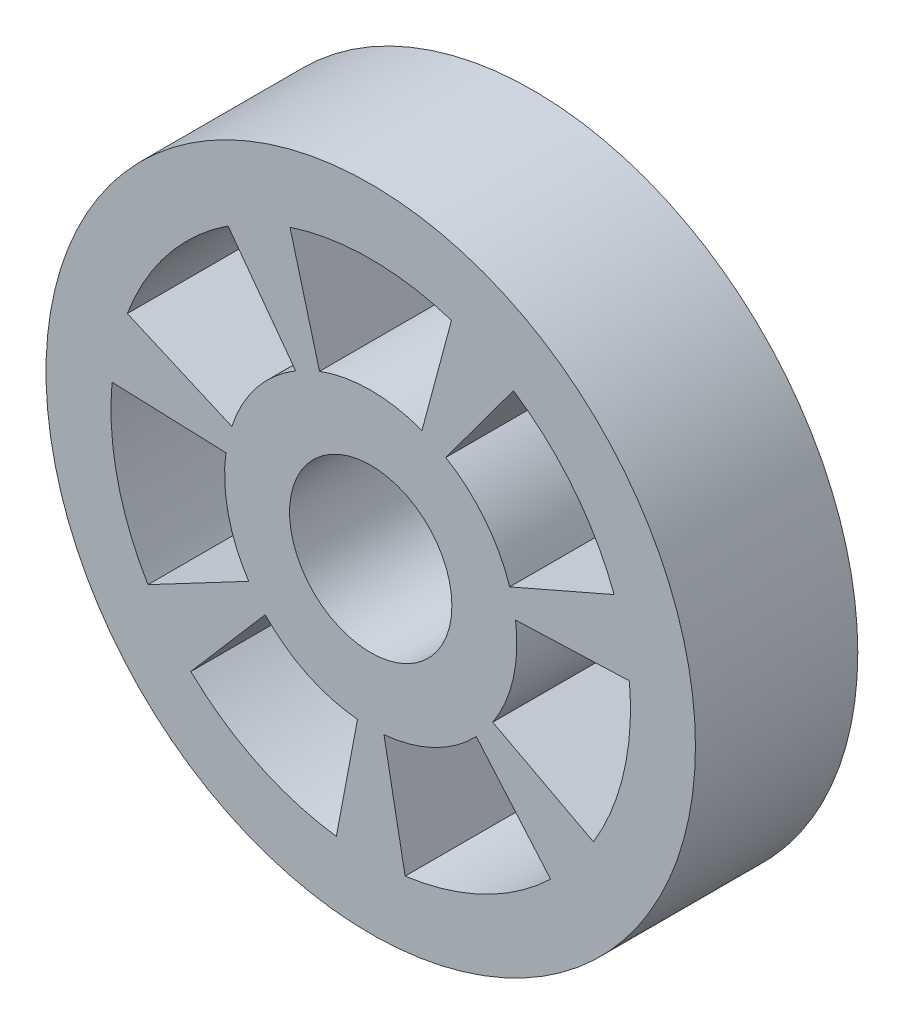
ISO-10303-21;
HEADER;
FILE_DESCRIPTION(('STEP AP214'),'2;1');
FILE_NAME('part.step','',(''),(''),'','','');
FILE_SCHEMA(('AUTOMOTIVE_DESIGN { 1 0 10303 214 1 1 1 1 }'));
ENDSEC;
DATA;
#1=APPLICATION_CONTEXT('core data for automotive mechanical design processes');
#2=APPLICATION_PROTOCOL_DEFINITION('international standard','automotive_design',2000,#1);
#3=PRODUCT_CONTEXT('',#1,'mechanical');
#4=PRODUCT('Part','Part','',(#3));
#5=PRODUCT_RELATED_PRODUCT_CATEGORY('part','',(#4));
#6=PRODUCT_DEFINITION_FORMATION('','',#4);
#7=PRODUCT_DEFINITION_CONTEXT('part definition',#1,'design');
#8=PRODUCT_DEFINITION('design','',#6,#7);
#9=PRODUCT_DEFINITION_SHAPE('','',#8);
#10=(LENGTH_UNIT() NAMED_UNIT(*) SI_UNIT(.MILLI.,.METRE.));
#11=(NAMED_UNIT(*) PLANE_ANGLE_UNIT() SI_UNIT($,.RADIAN.));
#12=(NAMED_UNIT(*) SI_UNIT($,.STERADIAN.) SOLID_ANGLE_UNIT());
#13=UNCERTAINTY_MEASURE_WITH_UNIT(LENGTH_MEASURE(1.E-05),#10,'distance_accuracy_value','');
#14=(GEOMETRIC_REPRESENTATION_CONTEXT(3) GLOBAL_UNCERTAINTY_ASSIGNED_CONTEXT((#13)) GLOBAL_UNIT_ASSIGNED_CONTEXT((#10,
#11,#12)) REPRESENTATION_CONTEXT('',''));
#15=CARTESIAN_POINT('',(0.,0.,0.));
#16=DIRECTION('',(0.,0.,1.));
#17=DIRECTION('',(1.,0.,0.));
#18=AXIS2_PLACEMENT_3D('',#15,#16,#17);
#19=CARTESIAN_POINT('',(0.,0.,25.));
#20=DIRECTION('',(0.,0.,1.));
#21=DIRECTION('',(1.,0.,0.));
#22=AXIS2_PLACEMENT_3D('',#19,#20,#21);
#23=PLANE('',#22);
#24=CARTESIAN_POINT('',(0.,0.,25.));
#25=DIRECTION('',(0.,0.,1.));
#26=DIRECTION('',(1.,0.,0.));
#27=AXIS2_PLACEMENT_3D('',#24,#25,#26);
#28=CIRCLE('',#27,50.);
#29=CARTESIAN_POINT('',(50.,0.,25.));
#30=VERTEX_POINT('',#29);
#31=EDGE_CURVE('E11',#30,#30,#28,.T.);
#32=ORIENTED_EDGE('',*,*,#31,.T.);
#33=EDGE_LOOP('',(#32));
#34=FACE_BOUND('',#33,.T.);
#35=CARTESIAN_POINT('',(0.,0.,25.));
#36=DIRECTION('',(0.,0.,1.));
#37=DIRECTION('',(1.,0.,0.));
#38=AXIS2_PLACEMENT_3D('',#35,#36,#37);
#39=CIRCLE('',#38,12.5);
#40=CARTESIAN_POINT('',(12.5,0.,25.));
#41=VERTEX_POINT('',#40);
#42=EDGE_CURVE('E532',#41,#41,#39,.T.);
#43=ORIENTED_EDGE('',*,*,#42,.F.);
#44=EDGE_LOOP('',(#43));
#45=FACE_BOUND('',#44,.T.);
#46=DIRECTION('',(0.258819045102521,0.965925826289068,0.));
#47=VECTOR('',#46,1.);
#48=CARTESIAN_POINT('',(7.88973220005182,21.0713579489188,25.));
#49=LINE('',#48,#47);
#50=CARTESIAN_POINT('',(7.88973220005182,21.0713579489188,25.));
#51=VERTEX_POINT('',#50);
#52=CARTESIAN_POINT('',(12.4309359990571,38.0193612543313,25.));
#53=VERTEX_POINT('',#52);
#54=EDGE_CURVE('E492',#51,#53,#49,.T.);
#55=ORIENTED_EDGE('',*,*,#54,.F.);
#56=CARTESIAN_POINT('',(0.,0.,25.));
#57=DIRECTION('',(0.,0.,-1.));
#58=DIRECTION('',(1.,0.,0.));
#59=AXIS2_PLACEMENT_3D('',#56,#57,#58);
#60=CIRCLE('',#59,22.5);
#61=CARTESIAN_POINT('',(-7.88973220005182,21.0713579489188,25.));
#62=VERTEX_POINT('',#61);
#63=EDGE_CURVE('E489',#62,#51,#60,.T.);
#64=ORIENTED_EDGE('',*,*,#63,.F.);
#65=DIRECTION('',(0.258819045102521,-0.965925826289068,0.));
#66=VECTOR('',#65,1.);
#67=CARTESIAN_POINT('',(-7.88973220005182,21.0713579489188,25.));
#68=LINE('',#67,#66);
#69=CARTESIAN_POINT('',(-12.4309359990571,38.0193612543313,25.));
#70=VERTEX_POINT('',#69);
#71=EDGE_CURVE('E500',#70,#62,#68,.T.);
#72=ORIENTED_EDGE('',*,*,#71,.F.);
#73=CARTESIAN_POINT('',(0.,0.,25.));
#74=DIRECTION('',(0.,0.,1.));
#75=DIRECTION('',(-1.,0.,0.));
#76=AXIS2_PLACEMENT_3D('',#73,#74,#75);
#77=CIRCLE('',#76,40.);
#78=EDGE_CURVE('E496',#53,#70,#77,.T.);
#79=ORIENTED_EDGE('',*,*,#78,.F.);
#80=EDGE_LOOP('',(#55,#64,#72,#79));
#81=FACE_BOUND('',#80,.T.);
#82=DIRECTION('',(0.916562255869977,0.399892024319738,0.));
#83=VECTOR('',#82,1.);
#84=CARTESIAN_POINT('',(21.3934185889465,6.96933577022356,25.));
#85=LINE('',#84,#83);
#86=CARTESIAN_POINT('',(21.3934185889465,6.96933577022356,25.));
#87=VERTEX_POINT('',#86);
#88=CARTESIAN_POINT('',(37.4752953949321,13.9857868946505,25.));
#89=VERTEX_POINT('',#88);
#90=EDGE_CURVE('E449',#87,#89,#85,.T.);
#91=ORIENTED_EDGE('',*,*,#90,.F.);
#92=CARTESIAN_POINT('',(0.,0.,25.));
#93=DIRECTION('',(0.,0.,-1.));
#94=DIRECTION('',(1.,0.,0.));
#95=AXIS2_PLACEMENT_3D('',#92,#93,#94);
#96=CIRCLE('',#95,22.5);
#97=CARTESIAN_POINT('',(11.555083456689,19.3062178147081,25.));
#98=VERTEX_POINT('',#97);
#99=EDGE_CURVE('E446',#98,#87,#96,.T.);
#100=ORIENTED_EDGE('',*,*,#99,.F.);
#101=DIRECTION('',(-0.593820185573503,-0.804597779766668,0.));
#102=VECTOR('',#101,1.);
#103=CARTESIAN_POINT('',(11.555083456689,19.3062178147081,25.));
#104=LINE('',#103,#102);
#105=CARTESIAN_POINT('',(21.9741717489908,33.4235811358666,25.));
#106=VERTEX_POINT('',#105);
#107=EDGE_CURVE('E457',#106,#98,#104,.T.);
#108=ORIENTED_EDGE('',*,*,#107,.F.);
#109=CARTESIAN_POINT('',(0.,0.,25.));
#110=DIRECTION('',(0.,0.,1.));
#111=DIRECTION('',(-1.,0.,0.));
#112=AXIS2_PLACEMENT_3D('',#109,#110,#111);
#113=CIRCLE('',#112,40.);
#114=EDGE_CURVE('E453',#89,#106,#113,.T.);
#115=ORIENTED_EDGE('',*,*,#114,.F.);
#116=EDGE_LOOP('',(#91,#100,#108,#115));
#117=FACE_BOUND('',#116,.T.);
#118=DIRECTION('',(0.884115393504608,-0.467268628273066,0.));
#119=VECTOR('',#118,1.);
#120=CARTESIAN_POINT('',(18.7874244341545,-12.3807383919915,25.));
#121=LINE('',#120,#119);
#122=CARTESIAN_POINT('',(18.7874244341545,-12.3807383919915,25.));
#123=VERTEX_POINT('',#122);
#124=CARTESIAN_POINT('',(34.2999930017103,-20.579370254763,25.));
#125=VERTEX_POINT('',#124);
#126=EDGE_CURVE('E406',#123,#125,#121,.T.);
#127=ORIENTED_EDGE('',*,*,#126,.F.);
#128=CARTESIAN_POINT('',(0.,0.,25.));
#129=DIRECTION('',(0.,0.,-1.));
#130=DIRECTION('',(1.,0.,0.));
#131=AXIS2_PLACEMENT_3D('',#128,#129,#130);
#132=CIRCLE('',#131,22.5);
#133=CARTESIAN_POINT('',(22.2986855897961,3.0031018909489,25.));
#134=VERTEX_POINT('',#133);
#135=EDGE_CURVE('E403',#134,#123,#132,.T.);
#136=ORIENTED_EDGE('',*,*,#135,.F.);
#137=DIRECTION('',(-0.999300704788399,-0.0373911942763224,0.));
#138=VECTOR('',#137,1.);
#139=CARTESIAN_POINT('',(22.2986855897961,3.0031018909489,25.));
#140=LINE('',#139,#138);
#141=CARTESIAN_POINT('',(39.8322799786331,3.65916270529013,25.));
#142=VERTEX_POINT('',#141);
#143=EDGE_CURVE('E414',#142,#134,#140,.T.);
#144=ORIENTED_EDGE('',*,*,#143,.F.);
#145=CARTESIAN_POINT('',(0.,0.,25.));
#146=DIRECTION('',(0.,0.,1.));
#147=DIRECTION('',(-1.,0.,0.));
#148=AXIS2_PLACEMENT_3D('',#145,#146,#147);
#149=CIRCLE('',#148,40.);
#150=EDGE_CURVE('E410',#125,#142,#149,.T.);
#151=ORIENTED_EDGE('',*,*,#150,.F.);
#152=EDGE_LOOP('',(#127,#136,#144,#151));
#153=FACE_BOUND('',#152,.T.);
#154=DIRECTION('',(0.185911607162908,-0.982566473233289,0.));
#155=VECTOR('',#154,1.);
#156=CARTESIAN_POINT('',(2.0341164868273,-22.4078640239988,25.));
#157=LINE('',#156,#155);
#158=CARTESIAN_POINT('',(2.0341164868273,-22.4078640239988,25.));
#159=VERTEX_POINT('',#158);
#160=CARTESIAN_POINT('',(5.29609628585234,-39.6478418596899,25.));
#161=VERTEX_POINT('',#160);
#162=EDGE_CURVE('E363',#159,#161,#157,.T.);
#163=ORIENTED_EDGE('',*,*,#162,.F.);
#164=CARTESIAN_POINT('',(0.,0.,25.));
#165=DIRECTION('',(0.,0.,-1.));
#166=DIRECTION('',(1.,0.,0.));
#167=AXIS2_PLACEMENT_3D('',#164,#165,#166);
#168=CIRCLE('',#167,22.5);
#169=CARTESIAN_POINT('',(16.2509226634952,-15.5614110088095,25.));
#170=VERTEX_POINT('',#169);
#171=EDGE_CURVE('E360',#170,#159,#168,.T.);
#172=ORIENTED_EDGE('',*,*,#171,.F.);
#173=DIRECTION('',(-0.652287411278117,0.757971723145457,0.));
#174=VECTOR('',#173,1.);
#175=CARTESIAN_POINT('',(16.2509226634952,-15.5614110088095,25.));
#176=LINE('',#175,#174);
#177=CARTESIAN_POINT('',(27.6958689539282,-28.8606798756862,25.));
#178=VERTEX_POINT('',#177);
#179=EDGE_CURVE('E371',#178,#170,#176,.T.);
#180=ORIENTED_EDGE('',*,*,#179,.F.);
#181=CARTESIAN_POINT('',(0.,0.,25.));
#182=DIRECTION('',(0.,0.,1.));
#183=DIRECTION('',(-1.,0.,0.));
#184=AXIS2_PLACEMENT_3D('',#181,#182,#183);
#185=CIRCLE('',#184,40.);
#186=EDGE_CURVE('E367',#161,#178,#185,.T.);
#187=ORIENTED_EDGE('',*,*,#186,.F.);
#188=EDGE_LOOP('',(#163,#172,#180,#187));
#189=FACE_BOUND('',#188,.T.);
#190=DIRECTION('',(-0.652287411278128,-0.757971723145447,0.));
#191=VECTOR('',#190,1.);
#192=CARTESIAN_POINT('',(-16.2509226634955,-15.5614110088093,25.));
#193=LINE('',#192,#191);
#194=CARTESIAN_POINT('',(-16.2509226634955,-15.5614110088093,25.));
#195=VERTEX_POINT('',#194);
#196=CARTESIAN_POINT('',(-27.6958689539286,-28.8606798756858,25.));
#197=VERTEX_POINT('',#196);
#198=EDGE_CURVE('E320',#195,#197,#193,.T.);
#199=ORIENTED_EDGE('',*,*,#198,.F.);
#200=CARTESIAN_POINT('',(0.,0.,25.));
#201=DIRECTION('',(0.,0.,-1.));
#202=DIRECTION('',(1.,0.,0.));
#203=AXIS2_PLACEMENT_3D('',#200,#201,#202);
#204=CIRCLE('',#203,22.5);
#205=CARTESIAN_POINT('',(-2.03411648682762,-22.4078640239987,25.));
#206=VERTEX_POINT('',#205);
#207=EDGE_CURVE('E317',#206,#195,#204,.T.);
#208=ORIENTED_EDGE('',*,*,#207,.F.);
#209=DIRECTION('',(0.185911607162922,0.982566473233287,0.));
#210=VECTOR('',#209,1.);
#211=CARTESIAN_POINT('',(-2.03411648682762,-22.4078640239987,25.));
#212=LINE('',#211,#210);
#213=CARTESIAN_POINT('',(-5.29609628585289,-39.6478418596899,25.));
#214=VERTEX_POINT('',#213);
#215=EDGE_CURVE('E328',#214,#206,#212,.T.);
#216=ORIENTED_EDGE('',*,*,#215,.F.);
#217=CARTESIAN_POINT('',(0.,0.,25.));
#218=DIRECTION('',(0.,0.,1.));
#219=DIRECTION('',(-1.,0.,0.));
#220=AXIS2_PLACEMENT_3D('',#217,#218,#219);
#221=CIRCLE('',#220,40.);
#222=EDGE_CURVE('E324',#197,#214,#221,.T.);
#223=ORIENTED_EDGE('',*,*,#222,.F.);
#224=EDGE_LOOP('',(#199,#208,#216,#223));
#225=FACE_BOUND('',#224,.T.);
#226=DIRECTION('',(-0.999300704788398,0.0373911942763359,0.));
#227=VECTOR('',#226,1.);
#228=CARTESIAN_POINT('',(-22.298685589796,3.0031018909492,25.));
#229=LINE('',#228,#227);
#230=CARTESIAN_POINT('',(-22.298685589796,3.0031018909492,25.));
#231=VERTEX_POINT('',#230);
#232=CARTESIAN_POINT('',(-39.832279978633,3.65916270529067,25.));
#233=VERTEX_POINT('',#232);
#234=EDGE_CURVE('E277',#231,#233,#229,.T.);
#235=ORIENTED_EDGE('',*,*,#234,.F.);
#236=CARTESIAN_POINT('',(0.,0.,25.));
#237=DIRECTION('',(0.,0.,-1.));
#238=DIRECTION('',(1.,0.,0.));
#239=AXIS2_PLACEMENT_3D('',#236,#237,#238);
#240=CIRCLE('',#239,22.5);
#241=CARTESIAN_POINT('',(-18.7874244341547,-12.3807383919913,25.));
#242=VERTEX_POINT('',#241);
#243=EDGE_CURVE('E274',#242,#231,#240,.T.);
#244=ORIENTED_EDGE('',*,*,#243,.F.);
#245=DIRECTION('',(0.884115393504614,0.467268628273054,0.));
#246=VECTOR('',#245,1.);
#247=CARTESIAN_POINT('',(-18.7874244341547,-12.3807383919913,25.));
#248=LINE('',#247,#246);
#249=CARTESIAN_POINT('',(-34.2999930017106,-20.5793702547626,25.));
#250=VERTEX_POINT('',#249);
#251=EDGE_CURVE('E285',#250,#242,#248,.T.);
#252=ORIENTED_EDGE('',*,*,#251,.F.);
#253=CARTESIAN_POINT('',(0.,0.,25.));
#254=DIRECTION('',(0.,0.,1.));
#255=DIRECTION('',(-1.,0.,0.));
#256=AXIS2_PLACEMENT_3D('',#253,#254,#255);
#257=CIRCLE('',#256,40.);
#258=EDGE_CURVE('E281',#233,#250,#257,.T.);
#259=ORIENTED_EDGE('',*,*,#258,.F.);
#260=EDGE_LOOP('',(#235,#244,#252,#259));
#261=FACE_BOUND('',#260,.T.);
#262=DIRECTION('',(-0.593820185573491,0.804597779766676,0.));
#263=VECTOR('',#262,1.);
#264=CARTESIAN_POINT('',(-11.5550834566887,19.3062178147083,25.));
#265=LINE('',#264,#263);
#266=CARTESIAN_POINT('',(-11.5550834566887,19.3062178147083,25.));
#267=VERTEX_POINT('',#266);
#268=CARTESIAN_POINT('',(-21.9741717489903,33.4235811358669,25.));
#269=VERTEX_POINT('',#268);
#270=EDGE_CURVE('E235',#267,#269,#265,.T.);
#271=ORIENTED_EDGE('',*,*,#270,.F.);
#272=CARTESIAN_POINT('',(0.,0.,25.));
#273=DIRECTION('',(0.,0.,-1.));
#274=DIRECTION('',(1.,0.,0.));
#275=AXIS2_PLACEMENT_3D('',#272,#273,#274);
#276=CIRCLE('',#275,22.5);
#277=CARTESIAN_POINT('',(-21.3934185889464,6.96933577022386,25.));
#278=VERTEX_POINT('',#277);
#279=EDGE_CURVE('E226',#278,#267,#276,.T.);
#280=ORIENTED_EDGE('',*,*,#279,.F.);
#281=DIRECTION('',(0.916562255869972,-0.399892024319752,0.));
#282=VECTOR('',#281,1.);
#283=CARTESIAN_POINT('',(-21.3934185889464,6.96933577022386,25.));
#284=LINE('',#283,#282);
#285=CARTESIAN_POINT('',(-37.4752953949319,13.9857868946511,25.));
#286=VERTEX_POINT('',#285);
#287=EDGE_CURVE('E252',#286,#278,#284,.T.);
#288=ORIENTED_EDGE('',*,*,#287,.F.);
#289=CARTESIAN_POINT('',(0.,0.,25.));
#290=DIRECTION('',(0.,0.,1.));
#291=DIRECTION('',(-1.,0.,0.));
#292=AXIS2_PLACEMENT_3D('',#289,#290,#291);
#293=CIRCLE('',#292,40.);
#294=EDGE_CURVE('E248',#269,#286,#293,.T.);
#295=ORIENTED_EDGE('',*,*,#294,.F.);
#296=EDGE_LOOP('',(#271,#280,#288,#295));
#297=FACE_BOUND('',#296,.T.);
#298=ADVANCED_FACE('F40',(#34,#45,#81,#117,#153,#189,#225,#261,#297),#23,.T.);
#299=CARTESIAN_POINT('',(0.,0.,0.));
#300=DIRECTION('',(0.,0.,1.));
#301=DIRECTION('',(1.,0.,0.));
#302=AXIS2_PLACEMENT_3D('',#299,#300,#301);
#303=PLANE('',#302);
#304=CARTESIAN_POINT('',(0.,0.,0.));
#305=DIRECTION('',(0.,0.,-1.));
#306=DIRECTION('',(1.,0.,0.));
#307=AXIS2_PLACEMENT_3D('',#304,#305,#306);
#308=CIRCLE('',#307,22.5);
#309=CARTESIAN_POINT('',(-18.7874244341547,-12.3807383919913,0.));
#310=VERTEX_POINT('',#309);
#311=CARTESIAN_POINT('',(-22.298685589796,3.0031018909492,0.));
#312=VERTEX_POINT('',#311);
#313=EDGE_CURVE('E244',#310,#312,#308,.T.);
#314=ORIENTED_EDGE('',*,*,#313,.T.);
#315=DIRECTION('',(-0.999300704788398,0.0373911942763359,0.));
#316=VECTOR('',#315,1.);
#317=CARTESIAN_POINT('',(-22.298685589796,3.0031018909492,0.));
#318=LINE('',#317,#316);
#319=CARTESIAN_POINT('',(-39.832279978633,3.65916270529067,0.));
#320=VERTEX_POINT('',#319);
#321=EDGE_CURVE('E292',#312,#320,#318,.T.);
#322=ORIENTED_EDGE('',*,*,#321,.T.);
#323=CARTESIAN_POINT('',(0.,0.,0.));
#324=DIRECTION('',(0.,0.,1.));
#325=DIRECTION('',(-1.,0.,0.));
#326=AXIS2_PLACEMENT_3D('',#323,#324,#325);
#327=CIRCLE('',#326,40.);
#328=CARTESIAN_POINT('',(-34.2999930017105,-20.5793702547626,0.));
#329=VERTEX_POINT('',#328);
#330=EDGE_CURVE('E296',#320,#329,#327,.T.);
#331=ORIENTED_EDGE('',*,*,#330,.T.);
#332=DIRECTION('',(0.884115393504614,0.467268628273054,0.));
#333=VECTOR('',#332,1.);
#334=CARTESIAN_POINT('',(-18.7874244341547,-12.3807383919913,0.));
#335=LINE('',#334,#333);
#336=EDGE_CURVE('E278',#329,#310,#335,.T.);
#337=ORIENTED_EDGE('',*,*,#336,.T.);
#338=EDGE_LOOP('',(#314,#322,#331,#337));
#339=FACE_BOUND('',#338,.T.);
#340=CARTESIAN_POINT('',(0.,0.,0.));
#341=DIRECTION('',(0.,0.,-1.));
#342=DIRECTION('',(1.,0.,0.));
#343=AXIS2_PLACEMENT_3D('',#340,#341,#342);
#344=CIRCLE('',#343,22.5);
#345=CARTESIAN_POINT('',(16.2509226634952,-15.5614110088095,0.));
#346=VERTEX_POINT('',#345);
#347=CARTESIAN_POINT('',(2.0341164868273,-22.4078640239988,0.));
#348=VERTEX_POINT('',#347);
#349=EDGE_CURVE('E359',#346,#348,#344,.T.);
#350=ORIENTED_EDGE('',*,*,#349,.T.);
#351=DIRECTION('',(0.185911607162908,-0.982566473233289,0.));
#352=VECTOR('',#351,1.);
#353=CARTESIAN_POINT('',(2.0341164868273,-22.4078640239988,0.));
#354=LINE('',#353,#352);
#355=CARTESIAN_POINT('',(5.29609628585234,-39.6478418596899,0.));
#356=VERTEX_POINT('',#355);
#357=EDGE_CURVE('E378',#348,#356,#354,.T.);
#358=ORIENTED_EDGE('',*,*,#357,.T.);
#359=CARTESIAN_POINT('',(0.,0.,0.));
#360=DIRECTION('',(0.,0.,1.));
#361=DIRECTION('',(-1.,0.,0.));
#362=AXIS2_PLACEMENT_3D('',#359,#360,#361);
#363=CIRCLE('',#362,40.);
#364=CARTESIAN_POINT('',(27.6958689539282,-28.8606798756862,0.));
#365=VERTEX_POINT('',#364);
#366=EDGE_CURVE('E382',#356,#365,#363,.T.);
#367=ORIENTED_EDGE('',*,*,#366,.T.);
#368=DIRECTION('',(-0.652287411278117,0.757971723145457,0.));
#369=VECTOR('',#368,1.);
#370=CARTESIAN_POINT('',(16.2509226634952,-15.5614110088095,0.));
#371=LINE('',#370,#369);
#372=EDGE_CURVE('E364',#365,#346,#371,.T.);
#373=ORIENTED_EDGE('',*,*,#372,.T.);
#374=EDGE_LOOP('',(#350,#358,#367,#373));
#375=FACE_BOUND('',#374,.T.);
#376=CARTESIAN_POINT('',(0.,0.,0.));
#377=DIRECTION('',(0.,0.,-1.));
#378=DIRECTION('',(1.,0.,0.));
#379=AXIS2_PLACEMENT_3D('',#376,#377,#378);
#380=CIRCLE('',#379,22.5);
#381=CARTESIAN_POINT('',(11.555083456689,19.3062178147081,0.));
#382=VERTEX_POINT('',#381);
#383=CARTESIAN_POINT('',(21.3934185889465,6.96933577022356,0.));
#384=VERTEX_POINT('',#383);
#385=EDGE_CURVE('E445',#382,#384,#380,.T.);
#386=ORIENTED_EDGE('',*,*,#385,.T.);
#387=DIRECTION('',(0.916562255869977,0.399892024319738,0.));
#388=VECTOR('',#387,1.);
#389=CARTESIAN_POINT('',(21.3934185889465,6.96933577022356,0.));
#390=LINE('',#389,#388);
#391=CARTESIAN_POINT('',(37.4752953949321,13.9857868946505,0.));
#392=VERTEX_POINT('',#391);
#393=EDGE_CURVE('E464',#384,#392,#390,.T.);
#394=ORIENTED_EDGE('',*,*,#393,.T.);
#395=CARTESIAN_POINT('',(0.,0.,0.));
#396=DIRECTION('',(0.,0.,1.));
#397=DIRECTION('',(-1.,0.,0.));
#398=AXIS2_PLACEMENT_3D('',#395,#396,#397);
#399=CIRCLE('',#398,40.);
#400=CARTESIAN_POINT('',(21.9741717489908,33.4235811358666,0.));
#401=VERTEX_POINT('',#400);
#402=EDGE_CURVE('E468',#392,#401,#399,.T.);
#403=ORIENTED_EDGE('',*,*,#402,.T.);
#404=DIRECTION('',(-0.593820185573503,-0.804597779766668,0.));
#405=VECTOR('',#404,1.);
#406=CARTESIAN_POINT('',(11.555083456689,19.3062178147081,0.));
#407=LINE('',#406,#405);
#408=EDGE_CURVE('E450',#401,#382,#407,.T.);
#409=ORIENTED_EDGE('',*,*,#408,.T.);
#410=EDGE_LOOP('',(#386,#394,#403,#409));
#411=FACE_BOUND('',#410,.T.);
#412=CARTESIAN_POINT('',(0.,0.,0.));
#413=DIRECTION('',(0.,0.,1.));
#414=DIRECTION('',(1.,0.,0.));
#415=AXIS2_PLACEMENT_3D('',#412,#413,#414);
#416=CIRCLE('',#415,12.5);
#417=CARTESIAN_POINT('',(12.5,0.,0.));
#418=VERTEX_POINT('',#417);
#419=EDGE_CURVE('E531',#418,#418,#416,.T.);
#420=ORIENTED_EDGE('',*,*,#419,.T.);
#421=EDGE_LOOP('',(#420));
#422=FACE_BOUND('',#421,.T.);
#423=CARTESIAN_POINT('',(0.,0.,0.));
#424=DIRECTION('',(0.,0.,1.));
#425=DIRECTION('',(1.,0.,0.));
#426=AXIS2_PLACEMENT_3D('',#423,#424,#425);
#427=CIRCLE('',#426,50.);
#428=CARTESIAN_POINT('',(50.,0.,0.));
#429=VERTEX_POINT('',#428);
#430=EDGE_CURVE('E44',#429,#429,#427,.T.);
#431=ORIENTED_EDGE('',*,*,#430,.F.);
#432=EDGE_LOOP('',(#431));
#433=FACE_BOUND('',#432,.T.);
#434=CARTESIAN_POINT('',(0.,0.,0.));
#435=DIRECTION('',(0.,0.,-1.));
#436=DIRECTION('',(1.,0.,0.));
#437=AXIS2_PLACEMENT_3D('',#434,#435,#436);
#438=CIRCLE('',#437,22.5);
#439=CARTESIAN_POINT('',(-7.88973220005182,21.0713579489188,0.));
#440=VERTEX_POINT('',#439);
#441=CARTESIAN_POINT('',(7.88973220005182,21.0713579489188,0.));
#442=VERTEX_POINT('',#441);
#443=EDGE_CURVE('E488',#440,#442,#438,.T.);
#444=ORIENTED_EDGE('',*,*,#443,.T.);
#445=DIRECTION('',(0.258819045102521,0.965925826289068,0.));
#446=VECTOR('',#445,1.);
#447=CARTESIAN_POINT('',(7.88973220005182,21.0713579489188,0.));
#448=LINE('',#447,#446);
#449=CARTESIAN_POINT('',(12.4309359990571,38.0193612543313,0.));
#450=VERTEX_POINT('',#449);
#451=EDGE_CURVE('E507',#442,#450,#448,.T.);
#452=ORIENTED_EDGE('',*,*,#451,.T.);
#453=CARTESIAN_POINT('',(0.,0.,0.));
#454=DIRECTION('',(0.,0.,1.));
#455=DIRECTION('',(-1.,0.,0.));
#456=AXIS2_PLACEMENT_3D('',#453,#454,#455);
#457=CIRCLE('',#456,40.);
#458=CARTESIAN_POINT('',(-12.4309359990571,38.0193612543313,0.));
#459=VERTEX_POINT('',#458);
#460=EDGE_CURVE('E511',#450,#459,#457,.T.);
#461=ORIENTED_EDGE('',*,*,#460,.T.);
#462=DIRECTION('',(0.258819045102521,-0.965925826289068,0.));
#463=VECTOR('',#462,1.);
#464=CARTESIAN_POINT('',(-7.88973220005182,21.0713579489188,0.));
#465=LINE('',#464,#463);
#466=EDGE_CURVE('E493',#459,#440,#465,.T.);
#467=ORIENTED_EDGE('',*,*,#466,.T.);
#468=EDGE_LOOP('',(#444,#452,#461,#467));
#469=FACE_BOUND('',#468,.T.);
#470=CARTESIAN_POINT('',(0.,0.,0.));
#471=DIRECTION('',(0.,0.,-1.));
#472=DIRECTION('',(1.,0.,0.));
#473=AXIS2_PLACEMENT_3D('',#470,#471,#472);
#474=CIRCLE('',#473,22.5);
#475=CARTESIAN_POINT('',(22.2986855897961,3.0031018909489,0.));
#476=VERTEX_POINT('',#475);
#477=CARTESIAN_POINT('',(18.7874244341545,-12.3807383919915,0.));
#478=VERTEX_POINT('',#477);
#479=EDGE_CURVE('E402',#476,#478,#474,.T.);
#480=ORIENTED_EDGE('',*,*,#479,.T.);
#481=DIRECTION('',(0.884115393504608,-0.467268628273066,0.));
#482=VECTOR('',#481,1.);
#483=CARTESIAN_POINT('',(18.7874244341545,-12.3807383919915,0.));
#484=LINE('',#483,#482);
#485=CARTESIAN_POINT('',(34.2999930017103,-20.579370254763,0.));
#486=VERTEX_POINT('',#485);
#487=EDGE_CURVE('E421',#478,#486,#484,.T.);
#488=ORIENTED_EDGE('',*,*,#487,.T.);
#489=CARTESIAN_POINT('',(0.,0.,0.));
#490=DIRECTION('',(0.,0.,1.));
#491=DIRECTION('',(-1.,0.,0.));
#492=AXIS2_PLACEMENT_3D('',#489,#490,#491);
#493=CIRCLE('',#492,40.);
#494=CARTESIAN_POINT('',(39.8322799786331,3.65916270529013,0.));
#495=VERTEX_POINT('',#494);
#496=EDGE_CURVE('E425',#486,#495,#493,.T.);
#497=ORIENTED_EDGE('',*,*,#496,.T.);
#498=DIRECTION('',(-0.999300704788399,-0.0373911942763224,0.));
#499=VECTOR('',#498,1.);
#500=CARTESIAN_POINT('',(22.2986855897961,3.0031018909489,0.));
#501=LINE('',#500,#499);
#502=EDGE_CURVE('E407',#495,#476,#501,.T.);
#503=ORIENTED_EDGE('',*,*,#502,.T.);
#504=EDGE_LOOP('',(#480,#488,#497,#503));
#505=FACE_BOUND('',#504,.T.);
#506=CARTESIAN_POINT('',(0.,0.,0.));
#507=DIRECTION('',(0.,0.,-1.));
#508=DIRECTION('',(1.,0.,0.));
#509=AXIS2_PLACEMENT_3D('',#506,#507,#508);
#510=CIRCLE('',#509,22.5);
#511=CARTESIAN_POINT('',(-2.03411648682762,-22.4078640239987,0.));
#512=VERTEX_POINT('',#511);
#513=CARTESIAN_POINT('',(-16.2509226634955,-15.5614110088093,0.));
#514=VERTEX_POINT('',#513);
#515=EDGE_CURVE('E316',#512,#514,#510,.T.);
#516=ORIENTED_EDGE('',*,*,#515,.T.);
#517=DIRECTION('',(-0.652287411278128,-0.757971723145447,0.));
#518=VECTOR('',#517,1.);
#519=CARTESIAN_POINT('',(-16.2509226634955,-15.5614110088093,0.));
#520=LINE('',#519,#518);
#521=CARTESIAN_POINT('',(-27.6958689539286,-28.8606798756858,0.));
#522=VERTEX_POINT('',#521);
#523=EDGE_CURVE('E335',#514,#522,#520,.T.);
#524=ORIENTED_EDGE('',*,*,#523,.T.);
#525=CARTESIAN_POINT('',(0.,0.,0.));
#526=DIRECTION('',(0.,0.,1.));
#527=DIRECTION('',(-1.,0.,0.));
#528=AXIS2_PLACEMENT_3D('',#525,#526,#527);
#529=CIRCLE('',#528,40.);
#530=CARTESIAN_POINT('',(-5.29609628585287,-39.6478418596899,0.));
#531=VERTEX_POINT('',#530);
#532=EDGE_CURVE('E339',#522,#531,#529,.T.);
#533=ORIENTED_EDGE('',*,*,#532,.T.);
#534=DIRECTION('',(0.185911607162922,0.982566473233287,0.));
#535=VECTOR('',#534,1.);
#536=CARTESIAN_POINT('',(-2.03411648682762,-22.4078640239987,0.));
#537=LINE('',#536,#535);
#538=EDGE_CURVE('E321',#531,#512,#537,.T.);
#539=ORIENTED_EDGE('',*,*,#538,.T.);
#540=EDGE_LOOP('',(#516,#524,#533,#539));
#541=FACE_BOUND('',#540,.T.);
#542=CARTESIAN_POINT('',(0.,0.,0.));
#543=DIRECTION('',(0.,0.,-1.));
#544=DIRECTION('',(1.,0.,0.));
#545=AXIS2_PLACEMENT_3D('',#542,#543,#544);
#546=CIRCLE('',#545,22.5);
#547=CARTESIAN_POINT('',(-21.3934185889464,6.96933577022386,0.));
#548=VERTEX_POINT('',#547);
#549=CARTESIAN_POINT('',(-11.5550834566887,19.3062178147083,0.));
#550=VERTEX_POINT('',#549);
#551=EDGE_CURVE('E64',#548,#550,#546,.T.);
#552=ORIENTED_EDGE('',*,*,#551,.T.);
#553=DIRECTION('',(-0.593820185573491,0.804597779766676,0.));
#554=VECTOR('',#553,1.);
#555=CARTESIAN_POINT('',(-11.5550834566887,19.3062178147083,0.));
#556=LINE('',#555,#554);
#557=CARTESIAN_POINT('',(-21.9741717489903,33.4235811358669,0.));
#558=VERTEX_POINT('',#557);
#559=EDGE_CURVE('E242',#550,#558,#556,.T.);
#560=ORIENTED_EDGE('',*,*,#559,.T.);
#561=CARTESIAN_POINT('',(0.,0.,0.));
#562=DIRECTION('',(0.,0.,1.));
#563=DIRECTION('',(-1.,0.,0.));
#564=AXIS2_PLACEMENT_3D('',#561,#562,#563);
#565=CIRCLE('',#564,40.);
#566=CARTESIAN_POINT('',(-37.4752953949319,13.9857868946511,0.));
#567=VERTEX_POINT('',#566);
#568=EDGE_CURVE('E261',#558,#567,#565,.T.);
#569=ORIENTED_EDGE('',*,*,#568,.T.);
#570=DIRECTION('',(0.916562255869972,-0.399892024319752,0.));
#571=VECTOR('',#570,1.);
#572=CARTESIAN_POINT('',(-21.3934185889464,6.96933577022386,0.));
#573=LINE('',#572,#571);
#574=EDGE_CURVE('E236',#567,#548,#573,.T.);
#575=ORIENTED_EDGE('',*,*,#574,.T.);
#576=EDGE_LOOP('',(#552,#560,#569,#575));
#577=FACE_BOUND('',#576,.T.);
#578=ADVANCED_FACE('F540',(#339,#375,#411,#422,#433,#469,#505,#541,#577),#303,.F.);
#579=CARTESIAN_POINT('',(0.,0.,25.));
#580=DIRECTION('',(0.,0.,-1.));
#581=DIRECTION('',(-1.,0.,0.));
#582=AXIS2_PLACEMENT_3D('',#579,#580,#581);
#583=CYLINDRICAL_SURFACE('',#582,50.);
#584=ORIENTED_EDGE('',*,*,#31,.F.);
#585=EDGE_LOOP('',(#584));
#586=FACE_BOUND('',#585,.T.);
#587=ORIENTED_EDGE('',*,*,#430,.T.);
#588=EDGE_LOOP('',(#587));
#589=FACE_BOUND('',#588,.T.);
#590=ADVANCED_FACE('F42',(#586,#589),#583,.T.);
#591=CARTESIAN_POINT('',(0.,0.,25.));
#592=DIRECTION('',(0.,0.,-1.));
#593=DIRECTION('',(-1.,0.,0.));
#594=AXIS2_PLACEMENT_3D('',#591,#592,#593);
#595=CYLINDRICAL_SURFACE('',#594,12.5);
#596=ORIENTED_EDGE('',*,*,#42,.T.);
#597=EDGE_LOOP('',(#596));
#598=FACE_BOUND('',#597,.T.);
#599=ORIENTED_EDGE('',*,*,#419,.F.);
#600=EDGE_LOOP('',(#599));
#601=FACE_BOUND('',#600,.T.);
#602=ADVANCED_FACE('F543',(#598,#601),#595,.F.);
#603=CARTESIAN_POINT('',(0.,0.,25.));
#604=DIRECTION('',(0.,0.,-1.));
#605=DIRECTION('',(-1.,0.,0.));
#606=AXIS2_PLACEMENT_3D('',#603,#604,#605);
#607=CYLINDRICAL_SURFACE('',#606,22.5);
#608=ORIENTED_EDGE('',*,*,#443,.F.);
#609=DIRECTION('',(0.,0.,-1.));
#610=VECTOR('',#609,1.);
#611=CARTESIAN_POINT('',(-7.88973220005182,21.0713579489188,25.));
#612=LINE('',#611,#610);
#613=EDGE_CURVE('E503',#62,#440,#612,.T.);
#614=ORIENTED_EDGE('',*,*,#613,.F.);
#615=ORIENTED_EDGE('',*,*,#63,.T.);
#616=DIRECTION('',(0.,0.,-1.));
#617=VECTOR('',#616,1.);
#618=CARTESIAN_POINT('',(7.88973220005182,21.0713579489188,25.));
#619=LINE('',#618,#617);
#620=EDGE_CURVE('E527',#51,#442,#619,.T.);
#621=ORIENTED_EDGE('',*,*,#620,.T.);
#622=EDGE_LOOP('',(#608,#614,#615,#621));
#623=FACE_BOUND('',#622,.T.);
#624=ADVANCED_FACE('F545',(#623),#607,.T.);
#625=CARTESIAN_POINT('',(7.88973220005182,21.0713579489188,25.));
#626=DIRECTION('',(-0.965925826289068,0.258819045102521,0.));
#627=DIRECTION('',(-0.258819045102521,-0.965925826289068,0.));
#628=AXIS2_PLACEMENT_3D('',#625,#626,#627);
#629=PLANE('',#628);
#630=ORIENTED_EDGE('',*,*,#451,.F.);
#631=ORIENTED_EDGE('',*,*,#620,.F.);
#632=ORIENTED_EDGE('',*,*,#54,.T.);
#633=DIRECTION('',(0.,0.,-1.));
#634=VECTOR('',#633,1.);
#635=CARTESIAN_POINT('',(12.4309359990571,38.0193612543313,25.));
#636=LINE('',#635,#634);
#637=EDGE_CURVE('E524',#53,#450,#636,.T.);
#638=ORIENTED_EDGE('',*,*,#637,.T.);
#639=EDGE_LOOP('',(#630,#631,#632,#638));
#640=FACE_BOUND('',#639,.T.);
#641=ADVANCED_FACE('F552',(#640),#629,.T.);
#642=CARTESIAN_POINT('',(0.,0.,25.));
#643=DIRECTION('',(0.,0.,-1.));
#644=DIRECTION('',(-1.,0.,0.));
#645=AXIS2_PLACEMENT_3D('',#642,#643,#644);
#646=CYLINDRICAL_SURFACE('',#645,40.);
#647=ORIENTED_EDGE('',*,*,#460,.F.);
#648=ORIENTED_EDGE('',*,*,#637,.F.);
#649=ORIENTED_EDGE('',*,*,#78,.T.);
#650=DIRECTION('',(0.,0.,-1.));
#651=VECTOR('',#650,1.);
#652=CARTESIAN_POINT('',(-12.4309359990571,38.0193612543313,25.));
#653=LINE('',#652,#651);
#654=EDGE_CURVE('E521',#70,#459,#653,.T.);
#655=ORIENTED_EDGE('',*,*,#654,.T.);
#656=EDGE_LOOP('',(#647,#648,#649,#655));
#657=FACE_BOUND('',#656,.T.);
#658=ADVANCED_FACE('F686',(#657),#646,.F.);
#659=CARTESIAN_POINT('',(-7.88973220005182,21.0713579489188,25.));
#660=DIRECTION('',(0.965925826289068,0.258819045102521,0.));
#661=DIRECTION('',(-0.258819045102521,0.965925826289068,0.));
#662=AXIS2_PLACEMENT_3D('',#659,#660,#661);
#663=PLANE('',#662);
#664=ORIENTED_EDGE('',*,*,#466,.F.);
#665=ORIENTED_EDGE('',*,*,#654,.F.);
#666=ORIENTED_EDGE('',*,*,#71,.T.);
#667=ORIENTED_EDGE('',*,*,#613,.T.);
#668=EDGE_LOOP('',(#664,#665,#666,#667));
#669=FACE_BOUND('',#668,.T.);
#670=ADVANCED_FACE('F682',(#669),#663,.T.);
#671=CARTESIAN_POINT('',(0.,0.,25.));
#672=DIRECTION('',(0.,0.,-1.));
#673=DIRECTION('',(-1.,0.,0.));
#674=AXIS2_PLACEMENT_3D('',#671,#672,#673);
#675=CYLINDRICAL_SURFACE('',#674,22.5);
#676=ORIENTED_EDGE('',*,*,#385,.F.);
#677=DIRECTION('',(0.,0.,-1.));
#678=VECTOR('',#677,1.);
#679=CARTESIAN_POINT('',(11.555083456689,19.3062178147081,25.));
#680=LINE('',#679,#678);
#681=EDGE_CURVE('E460',#98,#382,#680,.T.);
#682=ORIENTED_EDGE('',*,*,#681,.F.);
#683=ORIENTED_EDGE('',*,*,#99,.T.);
#684=DIRECTION('',(0.,0.,-1.));
#685=VECTOR('',#684,1.);
#686=CARTESIAN_POINT('',(21.3934185889465,6.96933577022356,25.));
#687=LINE('',#686,#685);
#688=EDGE_CURVE('E484',#87,#384,#687,.T.);
#689=ORIENTED_EDGE('',*,*,#688,.T.);
#690=EDGE_LOOP('',(#676,#682,#683,#689));
#691=FACE_BOUND('',#690,.T.);
#692=ADVANCED_FACE('F678',(#691),#675,.T.);
#693=CARTESIAN_POINT('',(21.3934185889465,6.96933577022356,25.));
#694=DIRECTION('',(-0.399892024319738,0.916562255869977,0.));
#695=DIRECTION('',(-0.916562255869977,-0.399892024319739,0.));
#696=AXIS2_PLACEMENT_3D('',#693,#694,#695);
#697=PLANE('',#696);
#698=ORIENTED_EDGE('',*,*,#393,.F.);
#699=ORIENTED_EDGE('',*,*,#688,.F.);
#700=ORIENTED_EDGE('',*,*,#90,.T.);
#701=DIRECTION('',(0.,0.,-1.));
#702=VECTOR('',#701,1.);
#703=CARTESIAN_POINT('',(37.4752953949321,13.9857868946505,25.));
#704=LINE('',#703,#702);
#705=EDGE_CURVE('E481',#89,#392,#704,.T.);
#706=ORIENTED_EDGE('',*,*,#705,.T.);
#707=EDGE_LOOP('',(#698,#699,#700,#706));
#708=FACE_BOUND('',#707,.T.);
#709=ADVANCED_FACE('F674',(#708),#697,.T.);
#710=CARTESIAN_POINT('',(0.,0.,25.));
#711=DIRECTION('',(0.,0.,-1.));
#712=DIRECTION('',(-1.,0.,0.));
#713=AXIS2_PLACEMENT_3D('',#710,#711,#712);
#714=CYLINDRICAL_SURFACE('',#713,40.);
#715=ORIENTED_EDGE('',*,*,#402,.F.);
#716=ORIENTED_EDGE('',*,*,#705,.F.);
#717=ORIENTED_EDGE('',*,*,#114,.T.);
#718=DIRECTION('',(0.,0.,-1.));
#719=VECTOR('',#718,1.);
#720=CARTESIAN_POINT('',(21.9741717489908,33.4235811358666,25.));
#721=LINE('',#720,#719);
#722=EDGE_CURVE('E478',#106,#401,#721,.T.);
#723=ORIENTED_EDGE('',*,*,#722,.T.);
#724=EDGE_LOOP('',(#715,#716,#717,#723));
#725=FACE_BOUND('',#724,.T.);
#726=ADVANCED_FACE('F670',(#725),#714,.F.);
#727=CARTESIAN_POINT('',(11.555083456689,19.3062178147081,25.));
#728=DIRECTION('',(0.804597779766668,-0.593820185573503,0.));
#729=DIRECTION('',(0.593820185573503,0.804597779766668,0.));
#730=AXIS2_PLACEMENT_3D('',#727,#728,#729);
#731=PLANE('',#730);
#732=ORIENTED_EDGE('',*,*,#408,.F.);
#733=ORIENTED_EDGE('',*,*,#722,.F.);
#734=ORIENTED_EDGE('',*,*,#107,.T.);
#735=ORIENTED_EDGE('',*,*,#681,.T.);
#736=EDGE_LOOP('',(#732,#733,#734,#735));
#737=FACE_BOUND('',#736,.T.);
#738=ADVANCED_FACE('F666',(#737),#731,.T.);
#739=CARTESIAN_POINT('',(0.,0.,25.));
#740=DIRECTION('',(0.,0.,-1.));
#741=DIRECTION('',(-1.,0.,0.));
#742=AXIS2_PLACEMENT_3D('',#739,#740,#741);
#743=CYLINDRICAL_SURFACE('',#742,22.5);
#744=ORIENTED_EDGE('',*,*,#479,.F.);
#745=DIRECTION('',(0.,0.,-1.));
#746=VECTOR('',#745,1.);
#747=CARTESIAN_POINT('',(22.2986855897961,3.0031018909489,25.));
#748=LINE('',#747,#746);
#749=EDGE_CURVE('E417',#134,#476,#748,.T.);
#750=ORIENTED_EDGE('',*,*,#749,.F.);
#751=ORIENTED_EDGE('',*,*,#135,.T.);
#752=DIRECTION('',(0.,0.,-1.));
#753=VECTOR('',#752,1.);
#754=CARTESIAN_POINT('',(18.7874244341545,-12.3807383919915,25.));
#755=LINE('',#754,#753);
#756=EDGE_CURVE('E441',#123,#478,#755,.T.);
#757=ORIENTED_EDGE('',*,*,#756,.T.);
#758=EDGE_LOOP('',(#744,#750,#751,#757));
#759=FACE_BOUND('',#758,.T.);
#760=ADVANCED_FACE('F662',(#759),#743,.T.);
#761=CARTESIAN_POINT('',(18.7874244341545,-12.3807383919915,25.));
#762=DIRECTION('',(0.467268628273066,0.884115393504608,0.));
#763=DIRECTION('',(-0.884115393504608,0.467268628273066,0.));
#764=AXIS2_PLACEMENT_3D('',#761,#762,#763);
#765=PLANE('',#764);
#766=ORIENTED_EDGE('',*,*,#487,.F.);
#767=ORIENTED_EDGE('',*,*,#756,.F.);
#768=ORIENTED_EDGE('',*,*,#126,.T.);
#769=DIRECTION('',(0.,0.,-1.));
#770=VECTOR('',#769,1.);
#771=CARTESIAN_POINT('',(34.2999930017103,-20.579370254763,25.));
#772=LINE('',#771,#770);
#773=EDGE_CURVE('E438',#125,#486,#772,.T.);
#774=ORIENTED_EDGE('',*,*,#773,.T.);
#775=EDGE_LOOP('',(#766,#767,#768,#774));
#776=FACE_BOUND('',#775,.T.);
#777=ADVANCED_FACE('F658',(#776),#765,.T.);
#778=CARTESIAN_POINT('',(0.,0.,25.));
#779=DIRECTION('',(0.,0.,-1.));
#780=DIRECTION('',(-1.,0.,0.));
#781=AXIS2_PLACEMENT_3D('',#778,#779,#780);
#782=CYLINDRICAL_SURFACE('',#781,40.);
#783=ORIENTED_EDGE('',*,*,#496,.F.);
#784=ORIENTED_EDGE('',*,*,#773,.F.);
#785=ORIENTED_EDGE('',*,*,#150,.T.);
#786=DIRECTION('',(0.,0.,-1.));
#787=VECTOR('',#786,1.);
#788=CARTESIAN_POINT('',(39.8322799786331,3.65916270529013,25.));
#789=LINE('',#788,#787);
#790=EDGE_CURVE('E435',#142,#495,#789,.T.);
#791=ORIENTED_EDGE('',*,*,#790,.T.);
#792=EDGE_LOOP('',(#783,#784,#785,#791));
#793=FACE_BOUND('',#792,.T.);
#794=ADVANCED_FACE('F654',(#793),#782,.F.);
#795=CARTESIAN_POINT('',(22.2986855897961,3.0031018909489,25.));
#796=DIRECTION('',(0.0373911942763224,-0.999300704788399,0.));
#797=DIRECTION('',(0.999300704788399,0.0373911942763224,0.));
#798=AXIS2_PLACEMENT_3D('',#795,#796,#797);
#799=PLANE('',#798);
#800=ORIENTED_EDGE('',*,*,#502,.F.);
#801=ORIENTED_EDGE('',*,*,#790,.F.);
#802=ORIENTED_EDGE('',*,*,#143,.T.);
#803=ORIENTED_EDGE('',*,*,#749,.T.);
#804=EDGE_LOOP('',(#800,#801,#802,#803));
#805=FACE_BOUND('',#804,.T.);
#806=ADVANCED_FACE('F650',(#805),#799,.T.);
#807=CARTESIAN_POINT('',(0.,0.,25.));
#808=DIRECTION('',(0.,0.,-1.));
#809=DIRECTION('',(-1.,0.,0.));
#810=AXIS2_PLACEMENT_3D('',#807,#808,#809);
#811=CYLINDRICAL_SURFACE('',#810,22.5);
#812=ORIENTED_EDGE('',*,*,#349,.F.);
#813=DIRECTION('',(0.,0.,-1.));
#814=VECTOR('',#813,1.);
#815=CARTESIAN_POINT('',(16.2509226634952,-15.5614110088095,25.));
#816=LINE('',#815,#814);
#817=EDGE_CURVE('E374',#170,#346,#816,.T.);
#818=ORIENTED_EDGE('',*,*,#817,.F.);
#819=ORIENTED_EDGE('',*,*,#171,.T.);
#820=DIRECTION('',(0.,0.,-1.));
#821=VECTOR('',#820,1.);
#822=CARTESIAN_POINT('',(2.0341164868273,-22.4078640239988,25.));
#823=LINE('',#822,#821);
#824=EDGE_CURVE('E398',#159,#348,#823,.T.);
#825=ORIENTED_EDGE('',*,*,#824,.T.);
#826=EDGE_LOOP('',(#812,#818,#819,#825));
#827=FACE_BOUND('',#826,.T.);
#828=ADVANCED_FACE('F646',(#827),#811,.T.);
#829=CARTESIAN_POINT('',(2.0341164868273,-22.4078640239988,25.));
#830=DIRECTION('',(0.982566473233289,0.185911607162908,0.));
#831=DIRECTION('',(-0.185911607162908,0.98256647323329,0.));
#832=AXIS2_PLACEMENT_3D('',#829,#830,#831);
#833=PLANE('',#832);
#834=ORIENTED_EDGE('',*,*,#357,.F.);
#835=ORIENTED_EDGE('',*,*,#824,.F.);
#836=ORIENTED_EDGE('',*,*,#162,.T.);
#837=DIRECTION('',(0.,0.,-1.));
#838=VECTOR('',#837,1.);
#839=CARTESIAN_POINT('',(5.29609628585234,-39.6478418596899,25.));
#840=LINE('',#839,#838);
#841=EDGE_CURVE('E395',#161,#356,#840,.T.);
#842=ORIENTED_EDGE('',*,*,#841,.T.);
#843=EDGE_LOOP('',(#834,#835,#836,#842));
#844=FACE_BOUND('',#843,.T.);
#845=ADVANCED_FACE('F642',(#844),#833,.T.);
#846=CARTESIAN_POINT('',(0.,0.,25.));
#847=DIRECTION('',(0.,0.,-1.));
#848=DIRECTION('',(-1.,0.,0.));
#849=AXIS2_PLACEMENT_3D('',#846,#847,#848);
#850=CYLINDRICAL_SURFACE('',#849,40.);
#851=ORIENTED_EDGE('',*,*,#366,.F.);
#852=ORIENTED_EDGE('',*,*,#841,.F.);
#853=ORIENTED_EDGE('',*,*,#186,.T.);
#854=DIRECTION('',(0.,0.,-1.));
#855=VECTOR('',#854,1.);
#856=CARTESIAN_POINT('',(27.6958689539282,-28.8606798756862,25.));
#857=LINE('',#856,#855);
#858=EDGE_CURVE('E392',#178,#365,#857,.T.);
#859=ORIENTED_EDGE('',*,*,#858,.T.);
#860=EDGE_LOOP('',(#851,#852,#853,#859));
#861=FACE_BOUND('',#860,.T.);
#862=ADVANCED_FACE('F638',(#861),#850,.F.);
#863=CARTESIAN_POINT('',(16.2509226634952,-15.5614110088095,25.));
#864=DIRECTION('',(-0.757971723145457,-0.652287411278117,0.));
#865=DIRECTION('',(0.652287411278117,-0.757971723145457,0.));
#866=AXIS2_PLACEMENT_3D('',#863,#864,#865);
#867=PLANE('',#866);
#868=ORIENTED_EDGE('',*,*,#372,.F.);
#869=ORIENTED_EDGE('',*,*,#858,.F.);
#870=ORIENTED_EDGE('',*,*,#179,.T.);
#871=ORIENTED_EDGE('',*,*,#817,.T.);
#872=EDGE_LOOP('',(#868,#869,#870,#871));
#873=FACE_BOUND('',#872,.T.);
#874=ADVANCED_FACE('F634',(#873),#867,.T.);
#875=CARTESIAN_POINT('',(0.,0.,25.));
#876=DIRECTION('',(0.,0.,-1.));
#877=DIRECTION('',(-1.,0.,0.));
#878=AXIS2_PLACEMENT_3D('',#875,#876,#877);
#879=CYLINDRICAL_SURFACE('',#878,22.5);
#880=ORIENTED_EDGE('',*,*,#515,.F.);
#881=DIRECTION('',(0.,0.,-1.));
#882=VECTOR('',#881,1.);
#883=CARTESIAN_POINT('',(-2.03411648682762,-22.4078640239987,25.));
#884=LINE('',#883,#882);
#885=EDGE_CURVE('E331',#206,#512,#884,.T.);
#886=ORIENTED_EDGE('',*,*,#885,.F.);
#887=ORIENTED_EDGE('',*,*,#207,.T.);
#888=DIRECTION('',(0.,0.,-1.));
#889=VECTOR('',#888,1.);
#890=CARTESIAN_POINT('',(-16.2509226634955,-15.5614110088093,25.));
#891=LINE('',#890,#889);
#892=EDGE_CURVE('E355',#195,#514,#891,.T.);
#893=ORIENTED_EDGE('',*,*,#892,.T.);
#894=EDGE_LOOP('',(#880,#886,#887,#893));
#895=FACE_BOUND('',#894,.T.);
#896=ADVANCED_FACE('F630',(#895),#879,.T.);
#897=CARTESIAN_POINT('',(-16.2509226634955,-15.5614110088093,25.));
#898=DIRECTION('',(0.757971723145447,-0.652287411278128,0.));
#899=DIRECTION('',(0.652287411278128,0.757971723145447,0.));
#900=AXIS2_PLACEMENT_3D('',#897,#898,#899);
#901=PLANE('',#900);
#902=ORIENTED_EDGE('',*,*,#523,.F.);
#903=ORIENTED_EDGE('',*,*,#892,.F.);
#904=ORIENTED_EDGE('',*,*,#198,.T.);
#905=DIRECTION('',(0.,0.,-1.));
#906=VECTOR('',#905,1.);
#907=CARTESIAN_POINT('',(-27.6958689539286,-28.8606798756858,25.));
#908=LINE('',#907,#906);
#909=EDGE_CURVE('E352',#197,#522,#908,.T.);
#910=ORIENTED_EDGE('',*,*,#909,.T.);
#911=EDGE_LOOP('',(#902,#903,#904,#910));
#912=FACE_BOUND('',#911,.T.);
#913=ADVANCED_FACE('F626',(#912),#901,.T.);
#914=CARTESIAN_POINT('',(0.,0.,25.));
#915=DIRECTION('',(0.,0.,-1.));
#916=DIRECTION('',(-1.,0.,0.));
#917=AXIS2_PLACEMENT_3D('',#914,#915,#916);
#918=CYLINDRICAL_SURFACE('',#917,40.);
#919=ORIENTED_EDGE('',*,*,#532,.F.);
#920=ORIENTED_EDGE('',*,*,#909,.F.);
#921=ORIENTED_EDGE('',*,*,#222,.T.);
#922=DIRECTION('',(0.,0.,-1.));
#923=VECTOR('',#922,1.);
#924=CARTESIAN_POINT('',(-5.29609628585287,-39.6478418596899,25.));
#925=LINE('',#924,#923);
#926=EDGE_CURVE('E349',#214,#531,#925,.T.);
#927=ORIENTED_EDGE('',*,*,#926,.T.);
#928=EDGE_LOOP('',(#919,#920,#921,#927));
#929=FACE_BOUND('',#928,.T.);
#930=ADVANCED_FACE('F622',(#929),#918,.F.);
#931=CARTESIAN_POINT('',(-2.03411648682762,-22.4078640239987,25.));
#932=DIRECTION('',(-0.982566473233287,0.185911607162922,0.));
#933=DIRECTION('',(-0.185911607162922,-0.982566473233287,0.));
#934=AXIS2_PLACEMENT_3D('',#931,#932,#933);
#935=PLANE('',#934);
#936=ORIENTED_EDGE('',*,*,#538,.F.);
#937=ORIENTED_EDGE('',*,*,#926,.F.);
#938=ORIENTED_EDGE('',*,*,#215,.T.);
#939=ORIENTED_EDGE('',*,*,#885,.T.);
#940=EDGE_LOOP('',(#936,#937,#938,#939));
#941=FACE_BOUND('',#940,.T.);
#942=ADVANCED_FACE('F619',(#941),#935,.T.);
#943=CARTESIAN_POINT('',(0.,0.,25.));
#944=DIRECTION('',(0.,0.,-1.));
#945=DIRECTION('',(-1.,0.,0.));
#946=AXIS2_PLACEMENT_3D('',#943,#944,#945);
#947=CYLINDRICAL_SURFACE('',#946,22.5);
#948=ORIENTED_EDGE('',*,*,#313,.F.);
#949=DIRECTION('',(0.,0.,-1.));
#950=VECTOR('',#949,1.);
#951=CARTESIAN_POINT('',(-18.7874244341547,-12.3807383919913,25.));
#952=LINE('',#951,#950);
#953=EDGE_CURVE('E288',#242,#310,#952,.T.);
#954=ORIENTED_EDGE('',*,*,#953,.F.);
#955=ORIENTED_EDGE('',*,*,#243,.T.);
#956=DIRECTION('',(0.,0.,-1.));
#957=VECTOR('',#956,1.);
#958=CARTESIAN_POINT('',(-22.298685589796,3.0031018909492,25.));
#959=LINE('',#958,#957);
#960=EDGE_CURVE('E312',#231,#312,#959,.T.);
#961=ORIENTED_EDGE('',*,*,#960,.T.);
#962=EDGE_LOOP('',(#948,#954,#955,#961));
#963=FACE_BOUND('',#962,.T.);
#964=ADVANCED_FACE('F601',(#963),#947,.T.);
#965=CARTESIAN_POINT('',(-22.298685589796,3.0031018909492,25.));
#966=DIRECTION('',(-0.0373911942763359,-0.999300704788398,0.));
#967=DIRECTION('',(0.999300704788398,-0.0373911942763359,0.));
#968=AXIS2_PLACEMENT_3D('',#965,#966,#967);
#969=PLANE('',#968);
#970=ORIENTED_EDGE('',*,*,#321,.F.);
#971=ORIENTED_EDGE('',*,*,#960,.F.);
#972=ORIENTED_EDGE('',*,*,#234,.T.);
#973=DIRECTION('',(0.,0.,-1.));
#974=VECTOR('',#973,1.);
#975=CARTESIAN_POINT('',(-39.832279978633,3.65916270529067,25.));
#976=LINE('',#975,#974);
#977=EDGE_CURVE('E309',#233,#320,#976,.T.);
#978=ORIENTED_EDGE('',*,*,#977,.T.);
#979=EDGE_LOOP('',(#970,#971,#972,#978));
#980=FACE_BOUND('',#979,.T.);
#981=ADVANCED_FACE('F594',(#980),#969,.T.);
#982=CARTESIAN_POINT('',(0.,0.,25.));
#983=DIRECTION('',(0.,0.,-1.));
#984=DIRECTION('',(-1.,0.,0.));
#985=AXIS2_PLACEMENT_3D('',#982,#983,#984);
#986=CYLINDRICAL_SURFACE('',#985,40.);
#987=ORIENTED_EDGE('',*,*,#330,.F.);
#988=ORIENTED_EDGE('',*,*,#977,.F.);
#989=ORIENTED_EDGE('',*,*,#258,.T.);
#990=DIRECTION('',(0.,0.,-1.));
#991=VECTOR('',#990,1.);
#992=CARTESIAN_POINT('',(-34.2999930017105,-20.5793702547626,25.));
#993=LINE('',#992,#991);
#994=EDGE_CURVE('E306',#250,#329,#993,.T.);
#995=ORIENTED_EDGE('',*,*,#994,.T.);
#996=EDGE_LOOP('',(#987,#988,#989,#995));
#997=FACE_BOUND('',#996,.T.);
#998=ADVANCED_FACE('F597',(#997),#986,.F.);
#999=CARTESIAN_POINT('',(-18.7874244341547,-12.3807383919913,25.));
#1000=DIRECTION('',(-0.467268628273054,0.884115393504614,0.));
#1001=DIRECTION('',(-0.884115393504614,-0.467268628273054,0.));
#1002=AXIS2_PLACEMENT_3D('',#999,#1000,#1001);
#1003=PLANE('',#1002);
#1004=ORIENTED_EDGE('',*,*,#336,.F.);
#1005=ORIENTED_EDGE('',*,*,#994,.F.);
#1006=ORIENTED_EDGE('',*,*,#251,.T.);
#1007=ORIENTED_EDGE('',*,*,#953,.T.);
#1008=EDGE_LOOP('',(#1004,#1005,#1006,#1007));
#1009=FACE_BOUND('',#1008,.T.);
#1010=ADVANCED_FACE('F604',(#1009),#1003,.T.);
#1011=CARTESIAN_POINT('',(0.,0.,25.));
#1012=DIRECTION('',(0.,0.,-1.));
#1013=DIRECTION('',(-1.,0.,0.));
#1014=AXIS2_PLACEMENT_3D('',#1011,#1012,#1013);
#1015=CYLINDRICAL_SURFACE('',#1014,22.5);
#1016=ORIENTED_EDGE('',*,*,#551,.F.);
#1017=DIRECTION('',(0.,0.,-1.));
#1018=VECTOR('',#1017,1.);
#1019=CARTESIAN_POINT('',(-21.3934185889464,6.96933577022386,25.));
#1020=LINE('',#1019,#1018);
#1021=EDGE_CURVE('E230',#278,#548,#1020,.T.);
#1022=ORIENTED_EDGE('',*,*,#1021,.F.);
#1023=ORIENTED_EDGE('',*,*,#279,.T.);
#1024=DIRECTION('',(0.,0.,-1.));
#1025=VECTOR('',#1024,1.);
#1026=CARTESIAN_POINT('',(-11.5550834566887,19.3062178147083,25.));
#1027=LINE('',#1026,#1025);
#1028=EDGE_CURVE('E229',#267,#550,#1027,.T.);
#1029=ORIENTED_EDGE('',*,*,#1028,.T.);
#1030=EDGE_LOOP('',(#1016,#1022,#1023,#1029));
#1031=FACE_BOUND('',#1030,.T.);
#1032=ADVANCED_FACE('F228',(#1031),#1015,.T.);
#1033=CARTESIAN_POINT('',(-11.5550834566887,19.3062178147083,25.));
#1034=DIRECTION('',(-0.804597779766676,-0.593820185573491,0.));
#1035=DIRECTION('',(0.593820185573491,-0.804597779766676,0.));
#1036=AXIS2_PLACEMENT_3D('',#1033,#1034,#1035);
#1037=PLANE('',#1036);
#1038=ORIENTED_EDGE('',*,*,#559,.F.);
#1039=ORIENTED_EDGE('',*,*,#1028,.F.);
#1040=ORIENTED_EDGE('',*,*,#270,.T.);
#1041=DIRECTION('',(0.,0.,-1.));
#1042=VECTOR('',#1041,1.);
#1043=CARTESIAN_POINT('',(-21.9741717489903,33.4235811358669,25.));
#1044=LINE('',#1043,#1042);
#1045=EDGE_CURVE('E245',#269,#558,#1044,.T.);
#1046=ORIENTED_EDGE('',*,*,#1045,.T.);
#1047=EDGE_LOOP('',(#1038,#1039,#1040,#1046));
#1048=FACE_BOUND('',#1047,.T.);
#1049=ADVANCED_FACE('F239',(#1048),#1037,.T.);
#1050=CARTESIAN_POINT('',(0.,0.,25.));
#1051=DIRECTION('',(0.,0.,-1.));
#1052=DIRECTION('',(-1.,0.,0.));
#1053=AXIS2_PLACEMENT_3D('',#1050,#1051,#1052);
#1054=CYLINDRICAL_SURFACE('',#1053,40.);
#1055=ORIENTED_EDGE('',*,*,#568,.F.);
#1056=ORIENTED_EDGE('',*,*,#1045,.F.);
#1057=ORIENTED_EDGE('',*,*,#294,.T.);
#1058=DIRECTION('',(0.,0.,-1.));
#1059=VECTOR('',#1058,1.);
#1060=CARTESIAN_POINT('',(-37.4752953949319,13.9857868946511,25.));
#1061=LINE('',#1060,#1059);
#1062=EDGE_CURVE('E56',#286,#567,#1061,.T.);
#1063=ORIENTED_EDGE('',*,*,#1062,.T.);
#1064=EDGE_LOOP('',(#1055,#1056,#1057,#1063));
#1065=FACE_BOUND('',#1064,.T.);
#1066=ADVANCED_FACE('F708',(#1065),#1054,.F.);
#1067=CARTESIAN_POINT('',(-21.3934185889464,6.96933577022386,25.));
#1068=DIRECTION('',(0.399892024319752,0.916562255869972,0.));
#1069=DIRECTION('',(-0.916562255869972,0.399892024319752,0.));
#1070=AXIS2_PLACEMENT_3D('',#1067,#1068,#1069);
#1071=PLANE('',#1070);
#1072=ORIENTED_EDGE('',*,*,#574,.F.);
#1073=ORIENTED_EDGE('',*,*,#1062,.F.);
#1074=ORIENTED_EDGE('',*,*,#287,.T.);
#1075=ORIENTED_EDGE('',*,*,#1021,.T.);
#1076=EDGE_LOOP('',(#1072,#1073,#1074,#1075));
#1077=FACE_BOUND('',#1076,.T.);
#1078=ADVANCED_FACE('F706',(#1077),#1071,.T.);
#1079=CLOSED_SHELL('',(#298,#578,#590,#602,#624,#641,#658,#670,#692,#709,#726,#738,#760,#777,
#794,#806,#828,#845,#862,#874,#896,#913,#930,#942,#964,#981,#998,#1010,#1032,#1049,#1066,#1078));
#1080=MANIFOLD_SOLID_BREP('B2',#1079);
#1081=ADVANCED_BREP_SHAPE_REPRESENTATION('',(#18,#1080),#14);
#1082=SHAPE_DEFINITION_REPRESENTATION(#9,#1081);
ENDSEC;
END-ISO-10303-21;
